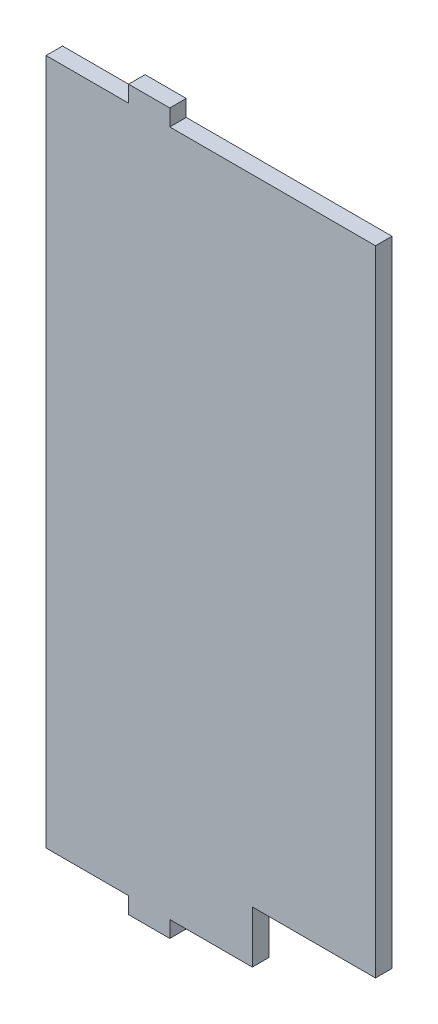
ISO-10303-21;
HEADER;
FILE_DESCRIPTION(('STEP AP214'),'2;1');
FILE_NAME('part.step','',(''),(''),'','','');
FILE_SCHEMA(('AUTOMOTIVE_DESIGN { 1 0 10303 214 1 1 1 1 }'));
ENDSEC;
DATA;
#1=APPLICATION_CONTEXT('core data for automotive mechanical design processes');
#2=APPLICATION_PROTOCOL_DEFINITION('international standard','automotive_design',2000,#1);
#3=PRODUCT_CONTEXT('',#1,'mechanical');
#4=PRODUCT('Part','Part','',(#3));
#5=PRODUCT_RELATED_PRODUCT_CATEGORY('part','',(#4));
#6=PRODUCT_DEFINITION_FORMATION('','',#4);
#7=PRODUCT_DEFINITION_CONTEXT('part definition',#1,'design');
#8=PRODUCT_DEFINITION('design','',#6,#7);
#9=PRODUCT_DEFINITION_SHAPE('','',#8);
#10=(LENGTH_UNIT() NAMED_UNIT(*) SI_UNIT(.MILLI.,.METRE.));
#11=(NAMED_UNIT(*) PLANE_ANGLE_UNIT() SI_UNIT($,.RADIAN.));
#12=(NAMED_UNIT(*) SI_UNIT($,.STERADIAN.) SOLID_ANGLE_UNIT());
#13=UNCERTAINTY_MEASURE_WITH_UNIT(LENGTH_MEASURE(1.E-05),#10,'distance_accuracy_value','');
#14=(GEOMETRIC_REPRESENTATION_CONTEXT(3) GLOBAL_UNCERTAINTY_ASSIGNED_CONTEXT((#13)) GLOBAL_UNIT_ASSIGNED_CONTEXT((#10,
#11,#12)) REPRESENTATION_CONTEXT('',''));
#15=CARTESIAN_POINT('',(0.,0.,0.));
#16=DIRECTION('',(0.,0.,1.));
#17=DIRECTION('',(1.,0.,0.));
#18=AXIS2_PLACEMENT_3D('',#15,#16,#17);
#19=CARTESIAN_POINT('',(-197.920305676856,125.,6.));
#20=DIRECTION('',(0.,-1.,0.));
#21=DIRECTION('',(0.,0.,-1.));
#22=AXIS2_PLACEMENT_3D('',#19,#20,#21);
#23=PLANE('',#22);
#24=DIRECTION('',(0.,0.,1.));
#25=VECTOR('',#24,1.);
#26=CARTESIAN_POINT('',(-167.850305676856,125.,0.));
#27=LINE('',#26,#25);
#28=CARTESIAN_POINT('',(-167.850305676856,125.,0.));
#29=VERTEX_POINT('',#28);
#30=CARTESIAN_POINT('',(-167.850305676856,125.,6.));
#31=VERTEX_POINT('',#30);
#32=EDGE_CURVE('E257',#29,#31,#27,.T.);
#33=ORIENTED_EDGE('',*,*,#32,.F.);
#34=DIRECTION('',(-1.,0.,0.));
#35=VECTOR('',#34,1.);
#36=CARTESIAN_POINT('',(-197.920305676856,125.,0.));
#37=LINE('',#36,#35);
#38=CARTESIAN_POINT('',(-197.920305676856,125.,0.));
#39=VERTEX_POINT('',#38);
#40=EDGE_CURVE('E159',#29,#39,#37,.T.);
#41=ORIENTED_EDGE('',*,*,#40,.T.);
#42=DIRECTION('',(0.,0.,-1.));
#43=VECTOR('',#42,1.);
#44=CARTESIAN_POINT('',(-197.920305676856,125.,6.));
#45=LINE('',#44,#43);
#46=CARTESIAN_POINT('',(-197.920305676856,125.,6.));
#47=VERTEX_POINT('',#46);
#48=EDGE_CURVE('E172',#47,#39,#45,.T.);
#49=ORIENTED_EDGE('',*,*,#48,.F.);
#50=DIRECTION('',(-1.,0.,0.));
#51=VECTOR('',#50,1.);
#52=CARTESIAN_POINT('',(-197.920305676856,125.,6.));
#53=LINE('',#52,#51);
#54=EDGE_CURVE('E231',#31,#47,#53,.T.);
#55=ORIENTED_EDGE('',*,*,#54,.F.);
#56=EDGE_LOOP('',(#33,#41,#49,#55));
#57=FACE_BOUND('',#56,.T.);
#58=ADVANCED_FACE('F33',(#57),#23,.F.);
#59=CARTESIAN_POINT('',(-197.920305676856,-125.,6.));
#60=DIRECTION('',(0.,1.,0.));
#61=DIRECTION('',(0.,0.,1.));
#62=AXIS2_PLACEMENT_3D('',#59,#60,#61);
#63=PLANE('',#62);
#64=DIRECTION('',(1.,0.,0.));
#65=VECTOR('',#64,1.);
#66=CARTESIAN_POINT('',(-197.920305676856,-125.,0.));
#67=LINE('',#66,#65);
#68=CARTESIAN_POINT('',(-152.850305676856,-125.,0.));
#69=VERTEX_POINT('',#68);
#70=CARTESIAN_POINT('',(-122.780305676856,-125.,0.));
#71=VERTEX_POINT('',#70);
#72=EDGE_CURVE('E164',#69,#71,#67,.T.);
#73=ORIENTED_EDGE('',*,*,#72,.T.);
#74=DIRECTION('',(0.,0.,1.));
#75=VECTOR('',#74,1.);
#76=CARTESIAN_POINT('',(-122.780305676856,-125.,0.));
#77=LINE('',#76,#75);
#78=CARTESIAN_POINT('',(-122.780305676856,-125.,6.));
#79=VERTEX_POINT('',#78);
#80=EDGE_CURVE('E290',#71,#79,#77,.T.);
#81=ORIENTED_EDGE('',*,*,#80,.T.);
#82=DIRECTION('',(1.,0.,0.));
#83=VECTOR('',#82,1.);
#84=CARTESIAN_POINT('',(-197.920305676856,-125.,6.));
#85=LINE('',#84,#83);
#86=CARTESIAN_POINT('',(-152.850305676856,-125.,6.));
#87=VERTEX_POINT('',#86);
#88=EDGE_CURVE('E208',#87,#79,#85,.T.);
#89=ORIENTED_EDGE('',*,*,#88,.F.);
#90=DIRECTION('',(0.,0.,1.));
#91=VECTOR('',#90,1.);
#92=CARTESIAN_POINT('',(-152.850305676856,-125.,0.));
#93=LINE('',#92,#91);
#94=EDGE_CURVE('E192',#69,#87,#93,.T.);
#95=ORIENTED_EDGE('',*,*,#94,.F.);
#96=EDGE_LOOP('',(#73,#81,#89,#95));
#97=FACE_BOUND('',#96,.T.);
#98=ADVANCED_FACE('F304',(#97),#63,.F.);
#99=CARTESIAN_POINT('',(-197.920305676856,125.,6.));
#100=DIRECTION('',(1.,0.,0.));
#101=DIRECTION('',(0.,1.,0.));
#102=AXIS2_PLACEMENT_3D('',#99,#100,#101);
#103=PLANE('',#102);
#104=DIRECTION('',(0.,-1.,0.));
#105=VECTOR('',#104,1.);
#106=CARTESIAN_POINT('',(-197.920305676856,125.,0.));
#107=LINE('',#106,#105);
#108=CARTESIAN_POINT('',(-197.920305676856,-125.,0.));
#109=VERTEX_POINT('',#108);
#110=EDGE_CURVE('E220',#39,#109,#107,.T.);
#111=ORIENTED_EDGE('',*,*,#110,.T.);
#112=DIRECTION('',(0.,0.,-1.));
#113=VECTOR('',#112,1.);
#114=CARTESIAN_POINT('',(-197.920305676856,-125.,6.));
#115=LINE('',#114,#113);
#116=CARTESIAN_POINT('',(-197.920305676856,-125.,6.));
#117=VERTEX_POINT('',#116);
#118=EDGE_CURVE('E11',#117,#109,#115,.T.);
#119=ORIENTED_EDGE('',*,*,#118,.F.);
#120=DIRECTION('',(0.,-1.,0.));
#121=VECTOR('',#120,1.);
#122=CARTESIAN_POINT('',(-197.920305676856,125.,6.));
#123=LINE('',#122,#121);
#124=EDGE_CURVE('E178',#47,#117,#123,.T.);
#125=ORIENTED_EDGE('',*,*,#124,.F.);
#126=ORIENTED_EDGE('',*,*,#48,.T.);
#127=EDGE_LOOP('',(#111,#119,#125,#126));
#128=FACE_BOUND('',#127,.T.);
#129=ADVANCED_FACE('F35',(#128),#103,.F.);
#130=CARTESIAN_POINT('',(-167.850305676856,-125.,0.));
#131=VERTEX_POINT('',#130);
#132=EDGE_CURVE('E160',#109,#131,#67,.T.);
#133=ORIENTED_EDGE('',*,*,#132,.T.);
#134=DIRECTION('',(0.,0.,1.));
#135=VECTOR('',#134,1.);
#136=CARTESIAN_POINT('',(-167.850305676856,-125.,0.));
#137=LINE('',#136,#135);
#138=CARTESIAN_POINT('',(-167.850305676856,-125.,6.));
#139=VERTEX_POINT('',#138);
#140=EDGE_CURVE('E195',#131,#139,#137,.T.);
#141=ORIENTED_EDGE('',*,*,#140,.T.);
#142=EDGE_CURVE('E216',#117,#139,#85,.T.);
#143=ORIENTED_EDGE('',*,*,#142,.F.);
#144=ORIENTED_EDGE('',*,*,#118,.T.);
#145=EDGE_LOOP('',(#133,#141,#143,#144));
#146=FACE_BOUND('',#145,.T.);
#147=ADVANCED_FACE('F328',(#146),#63,.F.);
#148=CARTESIAN_POINT('',(-77.920305676856,125.,6.));
#149=DIRECTION('',(-1.,0.,0.));
#150=DIRECTION('',(0.,-1.,0.));
#151=AXIS2_PLACEMENT_3D('',#148,#149,#150);
#152=PLANE('',#151);
#153=DIRECTION('',(0.,1.,0.));
#154=VECTOR('',#153,1.);
#155=CARTESIAN_POINT('',(-77.920305676856,125.,6.));
#156=LINE('',#155,#154);
#157=CARTESIAN_POINT('',(-77.920305676856,-106.,6.));
#158=VERTEX_POINT('',#157);
#159=CARTESIAN_POINT('',(-77.920305676856,125.,6.));
#160=VERTEX_POINT('',#159);
#161=EDGE_CURVE('E152',#158,#160,#156,.T.);
#162=ORIENTED_EDGE('',*,*,#161,.F.);
#163=DIRECTION('',(0.,0.,1.));
#164=VECTOR('',#163,1.);
#165=CARTESIAN_POINT('',(-77.920305676856,-106.,0.));
#166=LINE('',#165,#164);
#167=CARTESIAN_POINT('',(-77.920305676856,-106.,0.));
#168=VERTEX_POINT('',#167);
#169=EDGE_CURVE('E139',#168,#158,#166,.T.);
#170=ORIENTED_EDGE('',*,*,#169,.F.);
#171=DIRECTION('',(0.,1.,0.));
#172=VECTOR('',#171,1.);
#173=CARTESIAN_POINT('',(-77.920305676856,125.,0.));
#174=LINE('',#173,#172);
#175=CARTESIAN_POINT('',(-77.920305676856,125.,0.));
#176=VERTEX_POINT('',#175);
#177=EDGE_CURVE('E150',#168,#176,#174,.T.);
#178=ORIENTED_EDGE('',*,*,#177,.T.);
#179=DIRECTION('',(0.,0.,-1.));
#180=VECTOR('',#179,1.);
#181=CARTESIAN_POINT('',(-77.920305676856,125.,6.));
#182=LINE('',#181,#180);
#183=EDGE_CURVE('E42',#160,#176,#182,.T.);
#184=ORIENTED_EDGE('',*,*,#183,.F.);
#185=EDGE_LOOP('',(#162,#170,#178,#184));
#186=FACE_BOUND('',#185,.T.);
#187=ADVANCED_FACE('F148',(#186),#152,.F.);
#188=CARTESIAN_POINT('',(-152.850305676856,125.,0.));
#189=VERTEX_POINT('',#188);
#190=EDGE_CURVE('E158',#176,#189,#37,.T.);
#191=ORIENTED_EDGE('',*,*,#190,.T.);
#192=DIRECTION('',(0.,0.,1.));
#193=VECTOR('',#192,1.);
#194=CARTESIAN_POINT('',(-152.850305676856,125.,0.));
#195=LINE('',#194,#193);
#196=CARTESIAN_POINT('',(-152.850305676856,125.,6.));
#197=VERTEX_POINT('',#196);
#198=EDGE_CURVE('E277',#189,#197,#195,.T.);
#199=ORIENTED_EDGE('',*,*,#198,.T.);
#200=EDGE_CURVE('E224',#160,#197,#53,.T.);
#201=ORIENTED_EDGE('',*,*,#200,.F.);
#202=ORIENTED_EDGE('',*,*,#183,.T.);
#203=EDGE_LOOP('',(#191,#199,#201,#202));
#204=FACE_BOUND('',#203,.T.);
#205=ADVANCED_FACE('F324',(#204),#23,.F.);
#206=CARTESIAN_POINT('',(0.,0.,6.));
#207=DIRECTION('',(0.,0.,1.));
#208=DIRECTION('',(1.,0.,0.));
#209=AXIS2_PLACEMENT_3D('',#206,#207,#208);
#210=PLANE('',#209);
#211=DIRECTION('',(0.,-1.,0.));
#212=VECTOR('',#211,1.);
#213=CARTESIAN_POINT('',(-122.780305676856,-125.,6.));
#214=LINE('',#213,#212);
#215=CARTESIAN_POINT('',(-122.780305676856,-106.,6.));
#216=VERTEX_POINT('',#215);
#217=EDGE_CURVE('E144',#216,#79,#214,.T.);
#218=ORIENTED_EDGE('',*,*,#217,.F.);
#219=DIRECTION('',(-1.,0.,0.));
#220=VECTOR('',#219,1.);
#221=CARTESIAN_POINT('',(-77.920305676856,-106.,6.));
#222=LINE('',#221,#220);
#223=EDGE_CURVE('E299',#158,#216,#222,.T.);
#224=ORIENTED_EDGE('',*,*,#223,.F.);
#225=ORIENTED_EDGE('',*,*,#161,.T.);
#226=ORIENTED_EDGE('',*,*,#200,.T.);
#227=DIRECTION('',(0.,1.,0.));
#228=VECTOR('',#227,1.);
#229=CARTESIAN_POINT('',(-152.850305676856,125.,6.));
#230=LINE('',#229,#228);
#231=CARTESIAN_POINT('',(-152.850305676856,131.,6.));
#232=VERTEX_POINT('',#231);
#233=EDGE_CURVE('E58',#197,#232,#230,.T.);
#234=ORIENTED_EDGE('',*,*,#233,.T.);
#235=DIRECTION('',(-1.,0.,0.));
#236=VECTOR('',#235,1.);
#237=CARTESIAN_POINT('',(-167.850305676856,131.,6.));
#238=LINE('',#237,#236);
#239=CARTESIAN_POINT('',(-167.850305676856,131.,6.));
#240=VERTEX_POINT('',#239);
#241=EDGE_CURVE('E275',#232,#240,#238,.T.);
#242=ORIENTED_EDGE('',*,*,#241,.T.);
#243=DIRECTION('',(0.,-1.,0.));
#244=VECTOR('',#243,1.);
#245=CARTESIAN_POINT('',(-167.850305676856,125.,6.));
#246=LINE('',#245,#244);
#247=EDGE_CURVE('E285',#240,#31,#246,.T.);
#248=ORIENTED_EDGE('',*,*,#247,.T.);
#249=ORIENTED_EDGE('',*,*,#54,.T.);
#250=ORIENTED_EDGE('',*,*,#124,.T.);
#251=ORIENTED_EDGE('',*,*,#142,.T.);
#252=DIRECTION('',(0.,-1.,0.));
#253=VECTOR('',#252,1.);
#254=CARTESIAN_POINT('',(-167.850305676856,-125.,6.));
#255=LINE('',#254,#253);
#256=CARTESIAN_POINT('',(-167.850305676856,-131.,6.));
#257=VERTEX_POINT('',#256);
#258=EDGE_CURVE('E254',#139,#257,#255,.T.);
#259=ORIENTED_EDGE('',*,*,#258,.T.);
#260=DIRECTION('',(1.,0.,0.));
#261=VECTOR('',#260,1.);
#262=CARTESIAN_POINT('',(-167.850305676856,-131.,6.));
#263=LINE('',#262,#261);
#264=CARTESIAN_POINT('',(-152.850305676856,-131.,6.));
#265=VERTEX_POINT('',#264);
#266=EDGE_CURVE('E185',#257,#265,#263,.T.);
#267=ORIENTED_EDGE('',*,*,#266,.T.);
#268=DIRECTION('',(0.,1.,0.));
#269=VECTOR('',#268,1.);
#270=CARTESIAN_POINT('',(-152.850305676856,-125.,6.));
#271=LINE('',#270,#269);
#272=EDGE_CURVE('E181',#265,#87,#271,.T.);
#273=ORIENTED_EDGE('',*,*,#272,.T.);
#274=ORIENTED_EDGE('',*,*,#88,.T.);
#275=EDGE_LOOP('',(#218,#224,#225,#226,#234,#242,#248,#249,#250,#251,#259,#267,#273,#274));
#276=FACE_BOUND('',#275,.T.);
#277=ADVANCED_FACE('F309',(#276),#210,.T.);
#278=CARTESIAN_POINT('',(0.,0.,0.));
#279=DIRECTION('',(0.,0.,1.));
#280=DIRECTION('',(1.,0.,0.));
#281=AXIS2_PLACEMENT_3D('',#278,#279,#280);
#282=PLANE('',#281);
#283=DIRECTION('',(-1.,0.,0.));
#284=VECTOR('',#283,1.);
#285=CARTESIAN_POINT('',(-77.920305676856,-106.,0.));
#286=LINE('',#285,#284);
#287=CARTESIAN_POINT('',(-122.780305676856,-106.,0.));
#288=VERTEX_POINT('',#287);
#289=EDGE_CURVE('E135',#168,#288,#286,.T.);
#290=ORIENTED_EDGE('',*,*,#289,.T.);
#291=DIRECTION('',(0.,-1.,0.));
#292=VECTOR('',#291,1.);
#293=CARTESIAN_POINT('',(-122.780305676856,-125.,0.));
#294=LINE('',#293,#292);
#295=EDGE_CURVE('E50',#288,#71,#294,.T.);
#296=ORIENTED_EDGE('',*,*,#295,.T.);
#297=ORIENTED_EDGE('',*,*,#72,.F.);
#298=DIRECTION('',(0.,1.,0.));
#299=VECTOR('',#298,1.);
#300=CARTESIAN_POINT('',(-152.850305676856,-125.,0.));
#301=LINE('',#300,#299);
#302=CARTESIAN_POINT('',(-152.850305676856,-131.,0.));
#303=VERTEX_POINT('',#302);
#304=EDGE_CURVE('E188',#303,#69,#301,.T.);
#305=ORIENTED_EDGE('',*,*,#304,.F.);
#306=DIRECTION('',(1.,0.,0.));
#307=VECTOR('',#306,1.);
#308=CARTESIAN_POINT('',(-167.850305676856,-131.,0.));
#309=LINE('',#308,#307);
#310=CARTESIAN_POINT('',(-167.850305676856,-131.,0.));
#311=VERTEX_POINT('',#310);
#312=EDGE_CURVE('E191',#311,#303,#309,.T.);
#313=ORIENTED_EDGE('',*,*,#312,.F.);
#314=DIRECTION('',(0.,-1.,0.));
#315=VECTOR('',#314,1.);
#316=CARTESIAN_POINT('',(-167.850305676856,-125.,0.));
#317=LINE('',#316,#315);
#318=EDGE_CURVE('E184',#131,#311,#317,.T.);
#319=ORIENTED_EDGE('',*,*,#318,.F.);
#320=ORIENTED_EDGE('',*,*,#132,.F.);
#321=ORIENTED_EDGE('',*,*,#110,.F.);
#322=ORIENTED_EDGE('',*,*,#40,.F.);
#323=DIRECTION('',(0.,-1.,0.));
#324=VECTOR('',#323,1.);
#325=CARTESIAN_POINT('',(-167.850305676856,125.,0.));
#326=LINE('',#325,#324);
#327=CARTESIAN_POINT('',(-167.850305676856,131.,0.));
#328=VERTEX_POINT('',#327);
#329=EDGE_CURVE('E271',#328,#29,#326,.T.);
#330=ORIENTED_EDGE('',*,*,#329,.F.);
#331=DIRECTION('',(-1.,0.,0.));
#332=VECTOR('',#331,1.);
#333=CARTESIAN_POINT('',(-167.850305676856,131.,0.));
#334=LINE('',#333,#332);
#335=CARTESIAN_POINT('',(-152.850305676856,131.,0.));
#336=VERTEX_POINT('',#335);
#337=EDGE_CURVE('E281',#336,#328,#334,.T.);
#338=ORIENTED_EDGE('',*,*,#337,.F.);
#339=DIRECTION('',(0.,1.,0.));
#340=VECTOR('',#339,1.);
#341=CARTESIAN_POINT('',(-152.850305676856,125.,0.));
#342=LINE('',#341,#340);
#343=EDGE_CURVE('E284',#189,#336,#342,.T.);
#344=ORIENTED_EDGE('',*,*,#343,.F.);
#345=ORIENTED_EDGE('',*,*,#190,.F.);
#346=ORIENTED_EDGE('',*,*,#177,.F.);
#347=EDGE_LOOP('',(#290,#296,#297,#305,#313,#319,#320,#321,#322,#330,#338,#344,#345,#346));
#348=FACE_BOUND('',#347,.T.);
#349=ADVANCED_FACE('F155',(#348),#282,.F.);
#350=CARTESIAN_POINT('',(-167.850305676856,-125.,0.));
#351=DIRECTION('',(-1.,0.,0.));
#352=DIRECTION('',(0.,0.,1.));
#353=AXIS2_PLACEMENT_3D('',#350,#351,#352);
#354=PLANE('',#353);
#355=ORIENTED_EDGE('',*,*,#258,.F.);
#356=ORIENTED_EDGE('',*,*,#140,.F.);
#357=ORIENTED_EDGE('',*,*,#318,.T.);
#358=DIRECTION('',(0.,0.,1.));
#359=VECTOR('',#358,1.);
#360=CARTESIAN_POINT('',(-167.850305676856,-131.,0.));
#361=LINE('',#360,#359);
#362=EDGE_CURVE('E190',#311,#257,#361,.T.);
#363=ORIENTED_EDGE('',*,*,#362,.T.);
#364=EDGE_LOOP('',(#355,#356,#357,#363));
#365=FACE_BOUND('',#364,.T.);
#366=ADVANCED_FACE('F358',(#365),#354,.T.);
#367=CARTESIAN_POINT('',(-152.850305676856,-125.,0.));
#368=DIRECTION('',(1.,0.,0.));
#369=DIRECTION('',(0.,0.,-1.));
#370=AXIS2_PLACEMENT_3D('',#367,#368,#369);
#371=PLANE('',#370);
#372=ORIENTED_EDGE('',*,*,#272,.F.);
#373=DIRECTION('',(0.,0.,1.));
#374=VECTOR('',#373,1.);
#375=CARTESIAN_POINT('',(-152.850305676856,-131.,0.));
#376=LINE('',#375,#374);
#377=EDGE_CURVE('E196',#303,#265,#376,.T.);
#378=ORIENTED_EDGE('',*,*,#377,.F.);
#379=ORIENTED_EDGE('',*,*,#304,.T.);
#380=ORIENTED_EDGE('',*,*,#94,.T.);
#381=EDGE_LOOP('',(#372,#378,#379,#380));
#382=FACE_BOUND('',#381,.T.);
#383=ADVANCED_FACE('F307',(#382),#371,.T.);
#384=CARTESIAN_POINT('',(-167.850305676856,-131.,0.));
#385=DIRECTION('',(0.,-1.,0.));
#386=DIRECTION('',(0.,0.,-1.));
#387=AXIS2_PLACEMENT_3D('',#384,#385,#386);
#388=PLANE('',#387);
#389=ORIENTED_EDGE('',*,*,#266,.F.);
#390=ORIENTED_EDGE('',*,*,#362,.F.);
#391=ORIENTED_EDGE('',*,*,#312,.T.);
#392=ORIENTED_EDGE('',*,*,#377,.T.);
#393=EDGE_LOOP('',(#389,#390,#391,#392));
#394=FACE_BOUND('',#393,.T.);
#395=ADVANCED_FACE('F353',(#394),#388,.T.);
#396=CARTESIAN_POINT('',(-167.850305676856,125.,0.));
#397=DIRECTION('',(-1.,0.,0.));
#398=DIRECTION('',(0.,0.,1.));
#399=AXIS2_PLACEMENT_3D('',#396,#397,#398);
#400=PLANE('',#399);
#401=ORIENTED_EDGE('',*,*,#247,.F.);
#402=DIRECTION('',(0.,0.,1.));
#403=VECTOR('',#402,1.);
#404=CARTESIAN_POINT('',(-167.850305676856,131.,0.));
#405=LINE('',#404,#403);
#406=EDGE_CURVE('E258',#328,#240,#405,.T.);
#407=ORIENTED_EDGE('',*,*,#406,.F.);
#408=ORIENTED_EDGE('',*,*,#329,.T.);
#409=ORIENTED_EDGE('',*,*,#32,.T.);
#410=EDGE_LOOP('',(#401,#407,#408,#409));
#411=FACE_BOUND('',#410,.T.);
#412=ADVANCED_FACE('F346',(#411),#400,.T.);
#413=CARTESIAN_POINT('',(-167.850305676856,131.,0.));
#414=DIRECTION('',(0.,1.,0.));
#415=DIRECTION('',(0.,0.,1.));
#416=AXIS2_PLACEMENT_3D('',#413,#414,#415);
#417=PLANE('',#416);
#418=ORIENTED_EDGE('',*,*,#241,.F.);
#419=DIRECTION('',(0.,0.,1.));
#420=VECTOR('',#419,1.);
#421=CARTESIAN_POINT('',(-152.850305676856,131.,0.));
#422=LINE('',#421,#420);
#423=EDGE_CURVE('E264',#336,#232,#422,.T.);
#424=ORIENTED_EDGE('',*,*,#423,.F.);
#425=ORIENTED_EDGE('',*,*,#337,.T.);
#426=ORIENTED_EDGE('',*,*,#406,.T.);
#427=EDGE_LOOP('',(#418,#424,#425,#426));
#428=FACE_BOUND('',#427,.T.);
#429=ADVANCED_FACE('F319',(#428),#417,.T.);
#430=CARTESIAN_POINT('',(-152.850305676856,125.,0.));
#431=DIRECTION('',(1.,0.,0.));
#432=DIRECTION('',(0.,0.,-1.));
#433=AXIS2_PLACEMENT_3D('',#430,#431,#432);
#434=PLANE('',#433);
#435=ORIENTED_EDGE('',*,*,#233,.F.);
#436=ORIENTED_EDGE('',*,*,#198,.F.);
#437=ORIENTED_EDGE('',*,*,#343,.T.);
#438=ORIENTED_EDGE('',*,*,#423,.T.);
#439=EDGE_LOOP('',(#435,#436,#437,#438));
#440=FACE_BOUND('',#439,.T.);
#441=ADVANCED_FACE('F312',(#440),#434,.T.);
#442=CARTESIAN_POINT('',(-122.780305676856,-125.,0.));
#443=DIRECTION('',(-1.,0.,0.));
#444=DIRECTION('',(0.,-1.,0.));
#445=AXIS2_PLACEMENT_3D('',#442,#443,#444);
#446=PLANE('',#445);
#447=ORIENTED_EDGE('',*,*,#217,.T.);
#448=ORIENTED_EDGE('',*,*,#80,.F.);
#449=ORIENTED_EDGE('',*,*,#295,.F.);
#450=DIRECTION('',(0.,0.,1.));
#451=VECTOR('',#450,1.);
#452=CARTESIAN_POINT('',(-122.780305676856,-106.,0.));
#453=LINE('',#452,#451);
#454=EDGE_CURVE('E141',#288,#216,#453,.T.);
#455=ORIENTED_EDGE('',*,*,#454,.T.);
#456=EDGE_LOOP('',(#447,#448,#449,#455));
#457=FACE_BOUND('',#456,.T.);
#458=ADVANCED_FACE('F310',(#457),#446,.F.);
#459=CARTESIAN_POINT('',(-77.920305676856,-106.,0.));
#460=DIRECTION('',(0.,1.,0.));
#461=DIRECTION('',(0.,0.,1.));
#462=AXIS2_PLACEMENT_3D('',#459,#460,#461);
#463=PLANE('',#462);
#464=ORIENTED_EDGE('',*,*,#223,.T.);
#465=ORIENTED_EDGE('',*,*,#454,.F.);
#466=ORIENTED_EDGE('',*,*,#289,.F.);
#467=ORIENTED_EDGE('',*,*,#169,.T.);
#468=EDGE_LOOP('',(#464,#465,#466,#467));
#469=FACE_BOUND('',#468,.T.);
#470=ADVANCED_FACE('F138',(#469),#463,.F.);
#471=CLOSED_SHELL('',(#58,#98,#129,#147,#187,#205,#277,#349,#366,#383,#395,#412,#429,#441,#458,#470));
#472=MANIFOLD_SOLID_BREP('B2',#471);
#473=ADVANCED_BREP_SHAPE_REPRESENTATION('',(#18,#472),#14);
#474=SHAPE_DEFINITION_REPRESENTATION(#9,#473);
ENDSEC;
END-ISO-10303-21;
